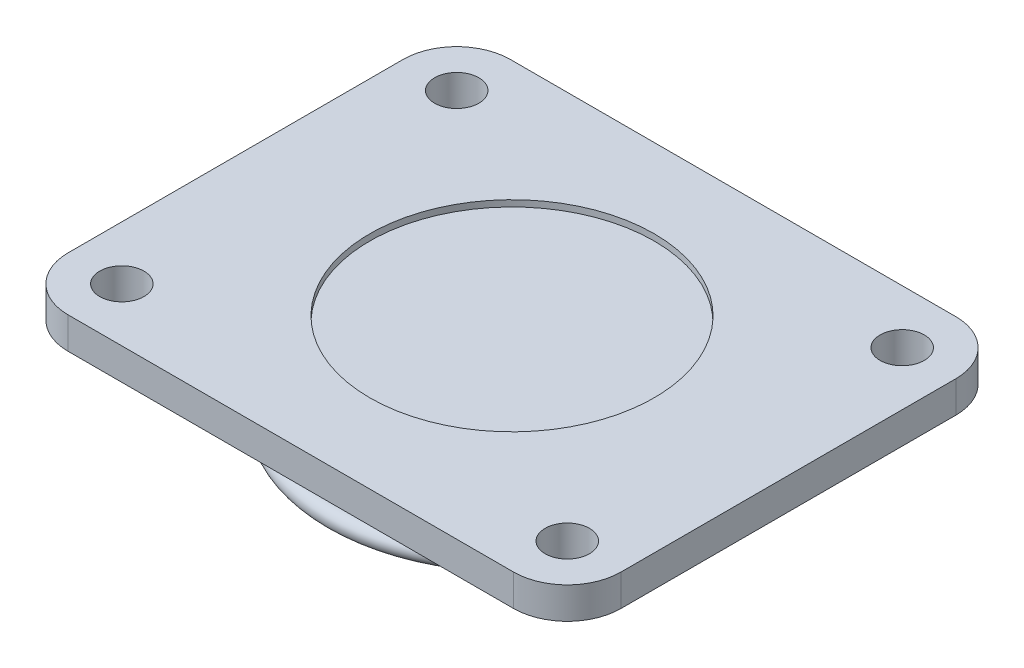
ISO-10303-21;
HEADER;
FILE_DESCRIPTION(('STEP AP214'),'2;1');
FILE_NAME('part.step','',(''),(''),'','','');
FILE_SCHEMA(('AUTOMOTIVE_DESIGN { 1 0 10303 214 1 1 1 1 }'));
ENDSEC;
DATA;
#1=APPLICATION_CONTEXT('core data for automotive mechanical design processes');
#2=APPLICATION_PROTOCOL_DEFINITION('international standard','automotive_design',2000,#1);
#3=PRODUCT_CONTEXT('',#1,'mechanical');
#4=PRODUCT('Part','Part','',(#3));
#5=PRODUCT_RELATED_PRODUCT_CATEGORY('part','',(#4));
#6=PRODUCT_DEFINITION_FORMATION('','',#4);
#7=PRODUCT_DEFINITION_CONTEXT('part definition',#1,'design');
#8=PRODUCT_DEFINITION('design','',#6,#7);
#9=PRODUCT_DEFINITION_SHAPE('','',#8);
#10=(LENGTH_UNIT() NAMED_UNIT(*) SI_UNIT(.MILLI.,.METRE.));
#11=(NAMED_UNIT(*) PLANE_ANGLE_UNIT() SI_UNIT($,.RADIAN.));
#12=(NAMED_UNIT(*) SI_UNIT($,.STERADIAN.) SOLID_ANGLE_UNIT());
#13=UNCERTAINTY_MEASURE_WITH_UNIT(LENGTH_MEASURE(1.E-05),#10,'distance_accuracy_value','');
#14=(GEOMETRIC_REPRESENTATION_CONTEXT(3) GLOBAL_UNCERTAINTY_ASSIGNED_CONTEXT((#13)) GLOBAL_UNIT_ASSIGNED_CONTEXT((#10,
#11,#12)) REPRESENTATION_CONTEXT('',''));
#15=CARTESIAN_POINT('',(0.,0.,0.));
#16=DIRECTION('',(0.,0.,1.));
#17=DIRECTION('',(1.,0.,0.));
#18=AXIS2_PLACEMENT_3D('',#15,#16,#17);
#19=CARTESIAN_POINT('',(70.5,10.,-53.));
#20=DIRECTION('',(0.,-1.,0.));
#21=DIRECTION('',(0.,0.,-1.));
#22=AXIS2_PLACEMENT_3D('',#19,#20,#21);
#23=PLANE('',#22);
#24=CARTESIAN_POINT('',(0.,10.,0.));
#25=DIRECTION('',(0.,1.,0.));
#26=DIRECTION('',(0.,0.,1.));
#27=AXIS2_PLACEMENT_3D('',#24,#25,#26);
#28=CIRCLE('',#27,45.);
#29=CARTESIAN_POINT('',(0.,10.,45.));
#30=VERTEX_POINT('',#29);
#31=EDGE_CURVE('E304',#30,#30,#28,.T.);
#32=ORIENTED_EDGE('',*,*,#31,.F.);
#33=EDGE_LOOP('',(#32));
#34=FACE_BOUND('',#33,.T.);
#35=CARTESIAN_POINT('',(70.5,10.,-53.));
#36=DIRECTION('',(0.,1.,0.));
#37=DIRECTION('',(0.,0.,-1.));
#38=AXIS2_PLACEMENT_3D('',#35,#36,#37);
#39=CIRCLE('',#38,17.);
#40=CARTESIAN_POINT('',(87.5,10.,-52.9999999999999));
#41=VERTEX_POINT('',#40);
#42=CARTESIAN_POINT('',(70.4999999999999,10.,-70.));
#43=VERTEX_POINT('',#42);
#44=EDGE_CURVE('E143',#41,#43,#39,.T.);
#45=ORIENTED_EDGE('',*,*,#44,.T.);
#46=DIRECTION('',(-1.,0.,0.));
#47=VECTOR('',#46,1.);
#48=CARTESIAN_POINT('',(-70.4999999999999,10.,-70.));
#49=LINE('',#48,#47);
#50=CARTESIAN_POINT('',(-70.4999999999999,10.,-70.));
#51=VERTEX_POINT('',#50);
#52=EDGE_CURVE('E77',#43,#51,#49,.T.);
#53=ORIENTED_EDGE('',*,*,#52,.T.);
#54=CARTESIAN_POINT('',(-70.5,10.,-53.));
#55=DIRECTION('',(0.,1.,0.));
#56=DIRECTION('',(0.,0.,-1.));
#57=AXIS2_PLACEMENT_3D('',#54,#55,#56);
#58=CIRCLE('',#57,17.);
#59=CARTESIAN_POINT('',(-87.5,10.,-52.9999999999999));
#60=VERTEX_POINT('',#59);
#61=EDGE_CURVE('E237',#51,#60,#58,.T.);
#62=ORIENTED_EDGE('',*,*,#61,.T.);
#63=DIRECTION('',(0.,0.,1.));
#64=VECTOR('',#63,1.);
#65=CARTESIAN_POINT('',(-87.5,10.,52.9999999999999));
#66=LINE('',#65,#64);
#67=CARTESIAN_POINT('',(-87.5,10.,52.9999999999999));
#68=VERTEX_POINT('',#67);
#69=EDGE_CURVE('E240',#60,#68,#66,.T.);
#70=ORIENTED_EDGE('',*,*,#69,.T.);
#71=CARTESIAN_POINT('',(-70.5,10.,53.));
#72=DIRECTION('',(0.,1.,0.));
#73=DIRECTION('',(0.,0.,-1.));
#74=AXIS2_PLACEMENT_3D('',#71,#72,#73);
#75=CIRCLE('',#74,17.);
#76=CARTESIAN_POINT('',(-70.4999999999999,10.,70.));
#77=VERTEX_POINT('',#76);
#78=EDGE_CURVE('E96',#68,#77,#75,.T.);
#79=ORIENTED_EDGE('',*,*,#78,.T.);
#80=DIRECTION('',(1.,0.,0.));
#81=VECTOR('',#80,1.);
#82=CARTESIAN_POINT('',(-70.4999999999999,10.,70.));
#83=LINE('',#82,#81);
#84=CARTESIAN_POINT('',(70.4999999999999,10.,70.));
#85=VERTEX_POINT('',#84);
#86=EDGE_CURVE('E90',#77,#85,#83,.T.);
#87=ORIENTED_EDGE('',*,*,#86,.T.);
#88=CARTESIAN_POINT('',(70.5,10.,53.));
#89=DIRECTION('',(0.,1.,0.));
#90=DIRECTION('',(0.,0.,1.));
#91=AXIS2_PLACEMENT_3D('',#88,#89,#90);
#92=CIRCLE('',#91,17.);
#93=CARTESIAN_POINT('',(87.5,10.,52.9999999999999));
#94=VERTEX_POINT('',#93);
#95=EDGE_CURVE('E94',#85,#94,#92,.T.);
#96=ORIENTED_EDGE('',*,*,#95,.T.);
#97=DIRECTION('',(0.,0.,-1.));
#98=VECTOR('',#97,1.);
#99=CARTESIAN_POINT('',(87.5,10.,52.9999999999999));
#100=LINE('',#99,#98);
#101=EDGE_CURVE('E33',#94,#41,#100,.T.);
#102=ORIENTED_EDGE('',*,*,#101,.T.);
#103=EDGE_LOOP('',(#45,#53,#62,#70,#79,#87,#96,#102));
#104=FACE_BOUND('',#103,.T.);
#105=CARTESIAN_POINT('',(-70.5,10.,-53.));
#106=DIRECTION('',(0.,1.,0.));
#107=DIRECTION('',(0.,0.,1.));
#108=AXIS2_PLACEMENT_3D('',#105,#106,#107);
#109=CIRCLE('',#108,7.);
#110=CARTESIAN_POINT('',(-70.5,10.,-46.));
#111=VERTEX_POINT('',#110);
#112=EDGE_CURVE('E125',#111,#111,#109,.T.);
#113=ORIENTED_EDGE('',*,*,#112,.F.);
#114=EDGE_LOOP('',(#113));
#115=FACE_BOUND('',#114,.T.);
#116=CARTESIAN_POINT('',(-70.5,10.,53.));
#117=DIRECTION('',(0.,1.,0.));
#118=DIRECTION('',(0.,0.,1.));
#119=AXIS2_PLACEMENT_3D('',#116,#117,#118);
#120=CIRCLE('',#119,7.);
#121=CARTESIAN_POINT('',(-70.5,10.,60.));
#122=VERTEX_POINT('',#121);
#123=EDGE_CURVE('E260',#122,#122,#120,.T.);
#124=ORIENTED_EDGE('',*,*,#123,.F.);
#125=EDGE_LOOP('',(#124));
#126=FACE_BOUND('',#125,.T.);
#127=CARTESIAN_POINT('',(70.5,10.,53.));
#128=DIRECTION('',(0.,1.,0.));
#129=DIRECTION('',(0.,0.,1.));
#130=AXIS2_PLACEMENT_3D('',#127,#128,#129);
#131=CIRCLE('',#130,7.);
#132=CARTESIAN_POINT('',(70.5,10.,60.));
#133=VERTEX_POINT('',#132);
#134=EDGE_CURVE('E268',#133,#133,#131,.T.);
#135=ORIENTED_EDGE('',*,*,#134,.F.);
#136=EDGE_LOOP('',(#135));
#137=FACE_BOUND('',#136,.T.);
#138=CARTESIAN_POINT('',(70.5,10.,-53.));
#139=DIRECTION('',(0.,1.,0.));
#140=DIRECTION('',(0.,0.,1.));
#141=AXIS2_PLACEMENT_3D('',#138,#139,#140);
#142=CIRCLE('',#141,7.);
#143=CARTESIAN_POINT('',(70.5,10.,-46.));
#144=VERTEX_POINT('',#143);
#145=EDGE_CURVE('E276',#144,#144,#142,.T.);
#146=ORIENTED_EDGE('',*,*,#145,.F.);
#147=EDGE_LOOP('',(#146));
#148=FACE_BOUND('',#147,.T.);
#149=ADVANCED_FACE('F15',(#34,#104,#115,#126,#137,#148),#23,.F.);
#150=CARTESIAN_POINT('',(70.5,0.,-53.));
#151=DIRECTION('',(0.,-1.,0.));
#152=DIRECTION('',(0.,0.,-1.));
#153=AXIS2_PLACEMENT_3D('',#150,#151,#152);
#154=PLANE('',#153);
#155=CARTESIAN_POINT('',(0.,0.,0.));
#156=DIRECTION('',(0.,-1.,0.));
#157=DIRECTION('',(0.,0.,-1.));
#158=AXIS2_PLACEMENT_3D('',#155,#156,#157);
#159=CIRCLE('',#158,56.);
#160=CARTESIAN_POINT('',(0.,0.,-56.));
#161=VERTEX_POINT('',#160);
#162=EDGE_CURVE('E284',#161,#161,#159,.T.);
#163=ORIENTED_EDGE('',*,*,#162,.F.);
#164=EDGE_LOOP('',(#163));
#165=FACE_BOUND('',#164,.T.);
#166=CARTESIAN_POINT('',(70.5,0.,53.));
#167=DIRECTION('',(0.,1.,0.));
#168=DIRECTION('',(0.,0.,1.));
#169=AXIS2_PLACEMENT_3D('',#166,#167,#168);
#170=CIRCLE('',#169,7.);
#171=CARTESIAN_POINT('',(70.5,0.,60.));
#172=VERTEX_POINT('',#171);
#173=EDGE_CURVE('E272',#172,#172,#170,.T.);
#174=ORIENTED_EDGE('',*,*,#173,.T.);
#175=EDGE_LOOP('',(#174));
#176=FACE_BOUND('',#175,.T.);
#177=CARTESIAN_POINT('',(-70.5,0.,-53.));
#178=DIRECTION('',(0.,1.,0.));
#179=DIRECTION('',(0.,0.,1.));
#180=AXIS2_PLACEMENT_3D('',#177,#178,#179);
#181=CIRCLE('',#180,7.);
#182=CARTESIAN_POINT('',(-70.5,0.,-46.));
#183=VERTEX_POINT('',#182);
#184=EDGE_CURVE('E256',#183,#183,#181,.T.);
#185=ORIENTED_EDGE('',*,*,#184,.T.);
#186=EDGE_LOOP('',(#185));
#187=FACE_BOUND('',#186,.T.);
#188=CARTESIAN_POINT('',(70.5,0.,-53.));
#189=DIRECTION('',(0.,1.,0.));
#190=DIRECTION('',(0.,0.,-1.));
#191=AXIS2_PLACEMENT_3D('',#188,#189,#190);
#192=CIRCLE('',#191,17.);
#193=CARTESIAN_POINT('',(87.5,0.,-52.9999999999999));
#194=VERTEX_POINT('',#193);
#195=CARTESIAN_POINT('',(70.4999999999999,0.,-70.));
#196=VERTEX_POINT('',#195);
#197=EDGE_CURVE('E120',#194,#196,#192,.T.);
#198=ORIENTED_EDGE('',*,*,#197,.F.);
#199=DIRECTION('',(0.,0.,-1.));
#200=VECTOR('',#199,1.);
#201=CARTESIAN_POINT('',(87.5,0.,52.9999999999999));
#202=LINE('',#201,#200);
#203=CARTESIAN_POINT('',(87.5,0.,52.9999999999999));
#204=VERTEX_POINT('',#203);
#205=EDGE_CURVE('E68',#204,#194,#202,.T.);
#206=ORIENTED_EDGE('',*,*,#205,.F.);
#207=CARTESIAN_POINT('',(70.5,0.,53.));
#208=DIRECTION('',(0.,1.,0.));
#209=DIRECTION('',(0.,0.,1.));
#210=AXIS2_PLACEMENT_3D('',#207,#208,#209);
#211=CIRCLE('',#210,17.);
#212=CARTESIAN_POINT('',(70.4999999999999,0.,70.));
#213=VERTEX_POINT('',#212);
#214=EDGE_CURVE('E62',#213,#204,#211,.T.);
#215=ORIENTED_EDGE('',*,*,#214,.F.);
#216=DIRECTION('',(1.,0.,0.));
#217=VECTOR('',#216,1.);
#218=CARTESIAN_POINT('',(-70.4999999999999,0.,70.));
#219=LINE('',#218,#217);
#220=CARTESIAN_POINT('',(-70.4999999999999,0.,70.));
#221=VERTEX_POINT('',#220);
#222=EDGE_CURVE('E105',#221,#213,#219,.T.);
#223=ORIENTED_EDGE('',*,*,#222,.F.);
#224=CARTESIAN_POINT('',(-70.5,0.,53.));
#225=DIRECTION('',(0.,1.,0.));
#226=DIRECTION('',(0.,0.,-1.));
#227=AXIS2_PLACEMENT_3D('',#224,#225,#226);
#228=CIRCLE('',#227,17.);
#229=CARTESIAN_POINT('',(-87.5,0.,52.9999999999999));
#230=VERTEX_POINT('',#229);
#231=EDGE_CURVE('E134',#230,#221,#228,.T.);
#232=ORIENTED_EDGE('',*,*,#231,.F.);
#233=DIRECTION('',(0.,0.,1.));
#234=VECTOR('',#233,1.);
#235=CARTESIAN_POINT('',(-87.5,0.,52.9999999999999));
#236=LINE('',#235,#234);
#237=CARTESIAN_POINT('',(-87.5,0.,-52.9999999999999));
#238=VERTEX_POINT('',#237);
#239=EDGE_CURVE('E131',#238,#230,#236,.T.);
#240=ORIENTED_EDGE('',*,*,#239,.F.);
#241=CARTESIAN_POINT('',(-70.5,0.,-53.));
#242=DIRECTION('',(0.,1.,0.));
#243=DIRECTION('',(0.,0.,-1.));
#244=AXIS2_PLACEMENT_3D('',#241,#242,#243);
#245=CIRCLE('',#244,17.);
#246=CARTESIAN_POINT('',(-70.4999999999999,0.,-70.));
#247=VERTEX_POINT('',#246);
#248=EDGE_CURVE('E128',#247,#238,#245,.T.);
#249=ORIENTED_EDGE('',*,*,#248,.F.);
#250=DIRECTION('',(-1.,0.,0.));
#251=VECTOR('',#250,1.);
#252=CARTESIAN_POINT('',(-70.4999999999999,0.,-70.));
#253=LINE('',#252,#251);
#254=EDGE_CURVE('E124',#196,#247,#253,.T.);
#255=ORIENTED_EDGE('',*,*,#254,.F.);
#256=EDGE_LOOP('',(#198,#206,#215,#223,#232,#240,#249,#255));
#257=FACE_BOUND('',#256,.T.);
#258=CARTESIAN_POINT('',(-70.5,0.,53.));
#259=DIRECTION('',(0.,1.,0.));
#260=DIRECTION('',(0.,0.,1.));
#261=AXIS2_PLACEMENT_3D('',#258,#259,#260);
#262=CIRCLE('',#261,7.);
#263=CARTESIAN_POINT('',(-70.5,0.,60.));
#264=VERTEX_POINT('',#263);
#265=EDGE_CURVE('E264',#264,#264,#262,.T.);
#266=ORIENTED_EDGE('',*,*,#265,.T.);
#267=EDGE_LOOP('',(#266));
#268=FACE_BOUND('',#267,.T.);
#269=CARTESIAN_POINT('',(70.5,0.,-53.));
#270=DIRECTION('',(0.,1.,0.));
#271=DIRECTION('',(0.,0.,1.));
#272=AXIS2_PLACEMENT_3D('',#269,#270,#271);
#273=CIRCLE('',#272,7.);
#274=CARTESIAN_POINT('',(70.5,0.,-46.));
#275=VERTEX_POINT('',#274);
#276=EDGE_CURVE('E280',#275,#275,#273,.T.);
#277=ORIENTED_EDGE('',*,*,#276,.T.);
#278=EDGE_LOOP('',(#277));
#279=FACE_BOUND('',#278,.T.);
#280=ADVANCED_FACE('F187',(#165,#176,#187,#257,#268,#279),#154,.T.);
#281=CARTESIAN_POINT('',(70.5,10.,-53.));
#282=DIRECTION('',(0.,-1.,0.));
#283=DIRECTION('',(0.,0.,-1.));
#284=AXIS2_PLACEMENT_3D('',#281,#282,#283);
#285=CYLINDRICAL_SURFACE('',#284,17.);
#286=ORIENTED_EDGE('',*,*,#197,.T.);
#287=DIRECTION('',(0.,-1.,0.));
#288=VECTOR('',#287,1.);
#289=CARTESIAN_POINT('',(70.4999999999999,10.,-70.));
#290=LINE('',#289,#288);
#291=EDGE_CURVE('E162',#43,#196,#290,.T.);
#292=ORIENTED_EDGE('',*,*,#291,.F.);
#293=ORIENTED_EDGE('',*,*,#44,.F.);
#294=DIRECTION('',(0.,-1.,0.));
#295=VECTOR('',#294,1.);
#296=CARTESIAN_POINT('',(87.5,10.,-52.9999999999999));
#297=LINE('',#296,#295);
#298=EDGE_CURVE('E116',#41,#194,#297,.T.);
#299=ORIENTED_EDGE('',*,*,#298,.T.);
#300=EDGE_LOOP('',(#286,#292,#293,#299));
#301=FACE_BOUND('',#300,.T.);
#302=ADVANCED_FACE('F194',(#301),#285,.T.);
#303=CARTESIAN_POINT('',(-70.4999999999999,10.,-70.));
#304=DIRECTION('',(0.,0.,1.));
#305=DIRECTION('',(1.,0.,0.));
#306=AXIS2_PLACEMENT_3D('',#303,#304,#305);
#307=PLANE('',#306);
#308=ORIENTED_EDGE('',*,*,#254,.T.);
#309=DIRECTION('',(0.,-1.,0.));
#310=VECTOR('',#309,1.);
#311=CARTESIAN_POINT('',(-70.4999999999999,10.,-70.));
#312=LINE('',#311,#310);
#313=EDGE_CURVE('E158',#51,#247,#312,.T.);
#314=ORIENTED_EDGE('',*,*,#313,.F.);
#315=ORIENTED_EDGE('',*,*,#52,.F.);
#316=ORIENTED_EDGE('',*,*,#291,.T.);
#317=EDGE_LOOP('',(#308,#314,#315,#316));
#318=FACE_BOUND('',#317,.T.);
#319=ADVANCED_FACE('F220',(#318),#307,.F.);
#320=CARTESIAN_POINT('',(-70.5,10.,-53.));
#321=DIRECTION('',(0.,-1.,0.));
#322=DIRECTION('',(0.,0.,-1.));
#323=AXIS2_PLACEMENT_3D('',#320,#321,#322);
#324=CYLINDRICAL_SURFACE('',#323,17.);
#325=ORIENTED_EDGE('',*,*,#248,.T.);
#326=DIRECTION('',(0.,-1.,0.));
#327=VECTOR('',#326,1.);
#328=CARTESIAN_POINT('',(-87.5,10.,-52.9999999999999));
#329=LINE('',#328,#327);
#330=EDGE_CURVE('E154',#60,#238,#329,.T.);
#331=ORIENTED_EDGE('',*,*,#330,.F.);
#332=ORIENTED_EDGE('',*,*,#61,.F.);
#333=ORIENTED_EDGE('',*,*,#313,.T.);
#334=EDGE_LOOP('',(#325,#331,#332,#333));
#335=FACE_BOUND('',#334,.T.);
#336=ADVANCED_FACE('F216',(#335),#324,.T.);
#337=CARTESIAN_POINT('',(-87.5,10.,52.9999999999999));
#338=DIRECTION('',(1.,0.,0.));
#339=DIRECTION('',(0.,0.,-1.));
#340=AXIS2_PLACEMENT_3D('',#337,#338,#339);
#341=PLANE('',#340);
#342=ORIENTED_EDGE('',*,*,#239,.T.);
#343=DIRECTION('',(0.,-1.,0.));
#344=VECTOR('',#343,1.);
#345=CARTESIAN_POINT('',(-87.5,10.,52.9999999999999));
#346=LINE('',#345,#344);
#347=EDGE_CURVE('E150',#68,#230,#346,.T.);
#348=ORIENTED_EDGE('',*,*,#347,.F.);
#349=ORIENTED_EDGE('',*,*,#69,.F.);
#350=ORIENTED_EDGE('',*,*,#330,.T.);
#351=EDGE_LOOP('',(#342,#348,#349,#350));
#352=FACE_BOUND('',#351,.T.);
#353=ADVANCED_FACE('F212',(#352),#341,.F.);
#354=CARTESIAN_POINT('',(-70.5,10.,53.));
#355=DIRECTION('',(0.,-1.,0.));
#356=DIRECTION('',(0.,0.,-1.));
#357=AXIS2_PLACEMENT_3D('',#354,#355,#356);
#358=CYLINDRICAL_SURFACE('',#357,17.);
#359=ORIENTED_EDGE('',*,*,#231,.T.);
#360=DIRECTION('',(0.,-1.,0.));
#361=VECTOR('',#360,1.);
#362=CARTESIAN_POINT('',(-70.4999999999999,10.,70.));
#363=LINE('',#362,#361);
#364=EDGE_CURVE('E107',#77,#221,#363,.T.);
#365=ORIENTED_EDGE('',*,*,#364,.F.);
#366=ORIENTED_EDGE('',*,*,#78,.F.);
#367=ORIENTED_EDGE('',*,*,#347,.T.);
#368=EDGE_LOOP('',(#359,#365,#366,#367));
#369=FACE_BOUND('',#368,.T.);
#370=ADVANCED_FACE('F209',(#369),#358,.T.);
#371=CARTESIAN_POINT('',(-70.4999999999999,10.,70.));
#372=DIRECTION('',(0.,0.,-1.));
#373=DIRECTION('',(-1.,0.,0.));
#374=AXIS2_PLACEMENT_3D('',#371,#372,#373);
#375=PLANE('',#374);
#376=ORIENTED_EDGE('',*,*,#222,.T.);
#377=DIRECTION('',(0.,-1.,0.));
#378=VECTOR('',#377,1.);
#379=CARTESIAN_POINT('',(70.4999999999999,10.,70.));
#380=LINE('',#379,#378);
#381=EDGE_CURVE('E102',#85,#213,#380,.T.);
#382=ORIENTED_EDGE('',*,*,#381,.F.);
#383=ORIENTED_EDGE('',*,*,#86,.F.);
#384=ORIENTED_EDGE('',*,*,#364,.T.);
#385=EDGE_LOOP('',(#376,#382,#383,#384));
#386=FACE_BOUND('',#385,.T.);
#387=ADVANCED_FACE('F103',(#386),#375,.F.);
#388=CARTESIAN_POINT('',(70.5,10.,53.));
#389=DIRECTION('',(0.,-1.,0.));
#390=DIRECTION('',(0.,0.,-1.));
#391=AXIS2_PLACEMENT_3D('',#388,#389,#390);
#392=CYLINDRICAL_SURFACE('',#391,17.);
#393=ORIENTED_EDGE('',*,*,#214,.T.);
#394=DIRECTION('',(0.,-1.,0.));
#395=VECTOR('',#394,1.);
#396=CARTESIAN_POINT('',(87.5,10.,52.9999999999999));
#397=LINE('',#396,#395);
#398=EDGE_CURVE('E108',#94,#204,#397,.T.);
#399=ORIENTED_EDGE('',*,*,#398,.F.);
#400=ORIENTED_EDGE('',*,*,#95,.F.);
#401=ORIENTED_EDGE('',*,*,#381,.T.);
#402=EDGE_LOOP('',(#393,#399,#400,#401));
#403=FACE_BOUND('',#402,.T.);
#404=ADVANCED_FACE('F110',(#403),#392,.T.);
#405=CARTESIAN_POINT('',(87.5,10.,52.9999999999999));
#406=DIRECTION('',(-1.,0.,0.));
#407=DIRECTION('',(0.,0.,1.));
#408=AXIS2_PLACEMENT_3D('',#405,#406,#407);
#409=PLANE('',#408);
#410=ORIENTED_EDGE('',*,*,#205,.T.);
#411=ORIENTED_EDGE('',*,*,#298,.F.);
#412=ORIENTED_EDGE('',*,*,#101,.F.);
#413=ORIENTED_EDGE('',*,*,#398,.T.);
#414=EDGE_LOOP('',(#410,#411,#412,#413));
#415=FACE_BOUND('',#414,.T.);
#416=ADVANCED_FACE('F202',(#415),#409,.F.);
#417=CARTESIAN_POINT('',(-70.5,10.,-53.));
#418=DIRECTION('',(0.,-1.,0.));
#419=DIRECTION('',(0.,0.,-1.));
#420=AXIS2_PLACEMENT_3D('',#417,#418,#419);
#421=CYLINDRICAL_SURFACE('',#420,7.);
#422=ORIENTED_EDGE('',*,*,#112,.T.);
#423=EDGE_LOOP('',(#422));
#424=FACE_BOUND('',#423,.T.);
#425=ORIENTED_EDGE('',*,*,#184,.F.);
#426=EDGE_LOOP('',(#425));
#427=FACE_BOUND('',#426,.T.);
#428=ADVANCED_FACE('F199',(#424,#427),#421,.F.);
#429=CARTESIAN_POINT('',(-70.5,10.,53.));
#430=DIRECTION('',(0.,-1.,0.));
#431=DIRECTION('',(0.,0.,-1.));
#432=AXIS2_PLACEMENT_3D('',#429,#430,#431);
#433=CYLINDRICAL_SURFACE('',#432,7.);
#434=ORIENTED_EDGE('',*,*,#123,.T.);
#435=EDGE_LOOP('',(#434));
#436=FACE_BOUND('',#435,.T.);
#437=ORIENTED_EDGE('',*,*,#265,.F.);
#438=EDGE_LOOP('',(#437));
#439=FACE_BOUND('',#438,.T.);
#440=ADVANCED_FACE('F341',(#436,#439),#433,.F.);
#441=CARTESIAN_POINT('',(70.5,10.,53.));
#442=DIRECTION('',(0.,-1.,0.));
#443=DIRECTION('',(0.,0.,-1.));
#444=AXIS2_PLACEMENT_3D('',#441,#442,#443);
#445=CYLINDRICAL_SURFACE('',#444,7.);
#446=ORIENTED_EDGE('',*,*,#134,.T.);
#447=EDGE_LOOP('',(#446));
#448=FACE_BOUND('',#447,.T.);
#449=ORIENTED_EDGE('',*,*,#173,.F.);
#450=EDGE_LOOP('',(#449));
#451=FACE_BOUND('',#450,.T.);
#452=ADVANCED_FACE('F338',(#448,#451),#445,.F.);
#453=CARTESIAN_POINT('',(70.5,10.,-53.));
#454=DIRECTION('',(0.,-1.,0.));
#455=DIRECTION('',(0.,0.,-1.));
#456=AXIS2_PLACEMENT_3D('',#453,#454,#455);
#457=CYLINDRICAL_SURFACE('',#456,7.);
#458=ORIENTED_EDGE('',*,*,#145,.T.);
#459=EDGE_LOOP('',(#458));
#460=FACE_BOUND('',#459,.T.);
#461=ORIENTED_EDGE('',*,*,#276,.F.);
#462=EDGE_LOOP('',(#461));
#463=FACE_BOUND('',#462,.T.);
#464=ADVANCED_FACE('F334',(#460,#463),#457,.F.);
#465=CARTESIAN_POINT('',(0.,-20.,0.));
#466=DIRECTION('',(0.,1.,0.));
#467=DIRECTION('',(0.,0.,1.));
#468=AXIS2_PLACEMENT_3D('',#465,#466,#467);
#469=CYLINDRICAL_SURFACE('',#468,56.);
#470=CARTESIAN_POINT('',(0.,-14.,0.));
#471=DIRECTION('',(0.,-1.,0.));
#472=DIRECTION('',(0.,0.,-1.));
#473=AXIS2_PLACEMENT_3D('',#470,#471,#472);
#474=CIRCLE('',#473,56.);
#475=CARTESIAN_POINT('',(0.,-14.,-56.));
#476=VERTEX_POINT('',#475);
#477=EDGE_CURVE('E291',#476,#476,#474,.F.);
#478=ORIENTED_EDGE('',*,*,#477,.T.);
#479=EDGE_LOOP('',(#478));
#480=FACE_BOUND('',#479,.T.);
#481=ORIENTED_EDGE('',*,*,#162,.T.);
#482=EDGE_LOOP('',(#481));
#483=FACE_BOUND('',#482,.T.);
#484=ADVANCED_FACE('F327',(#480,#483),#469,.T.);
#485=CARTESIAN_POINT('',(0.,-17.,0.));
#486=DIRECTION('',(0.,1.,0.));
#487=DIRECTION('',(0.,0.,1.));
#488=AXIS2_PLACEMENT_3D('',#485,#486,#487);
#489=TOROIDAL_SURFACE('',#488,56.,3.);
#490=CARTESIAN_POINT('',(0.,-20.,0.));
#491=DIRECTION('',(0.,1.,0.));
#492=DIRECTION('',(0.,0.,1.));
#493=AXIS2_PLACEMENT_3D('',#490,#491,#492);
#494=CIRCLE('',#493,56.);
#495=CARTESIAN_POINT('',(0.,-20.,56.));
#496=VERTEX_POINT('',#495);
#497=EDGE_CURVE('E295',#496,#496,#494,.T.);
#498=ORIENTED_EDGE('',*,*,#497,.T.);
#499=EDGE_LOOP('',(#498));
#500=FACE_BOUND('',#499,.T.);
#501=ORIENTED_EDGE('',*,*,#477,.F.);
#502=EDGE_LOOP('',(#501));
#503=FACE_BOUND('',#502,.T.);
#504=ADVANCED_FACE('F324',(#500,#503),#489,.T.);
#505=CARTESIAN_POINT('',(0.,-20.,0.));
#506=DIRECTION('',(0.,-1.,0.));
#507=DIRECTION('',(0.,0.,-1.));
#508=AXIS2_PLACEMENT_3D('',#505,#506,#507);
#509=PLANE('',#508);
#510=CARTESIAN_POINT('',(0.,-20.,0.));
#511=DIRECTION('',(0.,-1.,0.));
#512=DIRECTION('',(0.,0.,-1.));
#513=AXIS2_PLACEMENT_3D('',#510,#511,#512);
#514=CIRCLE('',#513,7.5);
#515=CARTESIAN_POINT('',(0.,-20.,-7.5));
#516=VERTEX_POINT('',#515);
#517=EDGE_CURVE('E299',#516,#516,#514,.T.);
#518=ORIENTED_EDGE('',*,*,#517,.F.);
#519=EDGE_LOOP('',(#518));
#520=FACE_BOUND('',#519,.T.);
#521=ORIENTED_EDGE('',*,*,#497,.F.);
#522=EDGE_LOOP('',(#521));
#523=FACE_BOUND('',#522,.T.);
#524=ADVANCED_FACE('F322',(#520,#523),#509,.T.);
#525=CARTESIAN_POINT('',(0.,-45.,0.));
#526=DIRECTION('',(0.,1.,0.));
#527=DIRECTION('',(0.,0.,1.));
#528=AXIS2_PLACEMENT_3D('',#525,#526,#527);
#529=CYLINDRICAL_SURFACE('',#528,7.5);
#530=CARTESIAN_POINT('',(0.,-44.,0.));
#531=DIRECTION('',(0.,-1.,0.));
#532=DIRECTION('',(0.,0.,-1.));
#533=AXIS2_PLACEMENT_3D('',#530,#531,#532);
#534=CIRCLE('',#533,7.5);
#535=CARTESIAN_POINT('',(0.,-44.,-7.5));
#536=VERTEX_POINT('',#535);
#537=EDGE_CURVE('E10',#536,#536,#534,.F.);
#538=ORIENTED_EDGE('',*,*,#537,.T.);
#539=EDGE_LOOP('',(#538));
#540=FACE_BOUND('',#539,.T.);
#541=ORIENTED_EDGE('',*,*,#517,.T.);
#542=EDGE_LOOP('',(#541));
#543=FACE_BOUND('',#542,.T.);
#544=ADVANCED_FACE('F183',(#540,#543),#529,.T.);
#545=CARTESIAN_POINT('',(0.,-45.,0.));
#546=DIRECTION('',(0.,-1.,0.));
#547=DIRECTION('',(0.,0.,-1.));
#548=AXIS2_PLACEMENT_3D('',#545,#546,#547);
#549=PLANE('',#548);
#550=CARTESIAN_POINT('',(0.,-45.,0.));
#551=DIRECTION('',(0.,-1.,0.));
#552=DIRECTION('',(0.,0.,-1.));
#553=AXIS2_PLACEMENT_3D('',#550,#551,#552);
#554=CIRCLE('',#553,6.50000000000001);
#555=CARTESIAN_POINT('',(0.,-45.,-6.50000000000001));
#556=VERTEX_POINT('',#555);
#557=EDGE_CURVE('E25',#556,#556,#554,.T.);
#558=ORIENTED_EDGE('',*,*,#557,.T.);
#559=EDGE_LOOP('',(#558));
#560=FACE_BOUND('',#559,.T.);
#561=ADVANCED_FACE('F169',(#560),#549,.T.);
#562=CARTESIAN_POINT('',(0.,-45.,0.));
#563=DIRECTION('',(0.,1.,0.));
#564=DIRECTION('',(0.,0.,1.));
#565=AXIS2_PLACEMENT_3D('',#562,#563,#564);
#566=CONICAL_SURFACE('',#565,6.50000000000001,0.785398163397435);
#567=ORIENTED_EDGE('',*,*,#537,.F.);
#568=EDGE_LOOP('',(#567));
#569=FACE_BOUND('',#568,.T.);
#570=ORIENTED_EDGE('',*,*,#557,.F.);
#571=EDGE_LOOP('',(#570));
#572=FACE_BOUND('',#571,.T.);
#573=ADVANCED_FACE('F17',(#569,#572),#566,.T.);
#574=CARTESIAN_POINT('',(0.,8.,0.));
#575=DIRECTION('',(0.,1.,0.));
#576=DIRECTION('',(0.,0.,1.));
#577=AXIS2_PLACEMENT_3D('',#574,#575,#576);
#578=CYLINDRICAL_SURFACE('',#577,45.);
#579=CARTESIAN_POINT('',(0.,8.,0.));
#580=DIRECTION('',(0.,1.,0.));
#581=DIRECTION('',(0.,0.,1.));
#582=AXIS2_PLACEMENT_3D('',#579,#580,#581);
#583=CIRCLE('',#582,45.);
#584=CARTESIAN_POINT('',(0.,8.,45.));
#585=VERTEX_POINT('',#584);
#586=EDGE_CURVE('E303',#585,#585,#583,.T.);
#587=ORIENTED_EDGE('',*,*,#586,.F.);
#588=EDGE_LOOP('',(#587));
#589=FACE_BOUND('',#588,.T.);
#590=ORIENTED_EDGE('',*,*,#31,.T.);
#591=EDGE_LOOP('',(#590));
#592=FACE_BOUND('',#591,.T.);
#593=ADVANCED_FACE('F172',(#589,#592),#578,.F.);
#594=CARTESIAN_POINT('',(0.,8.,0.));
#595=DIRECTION('',(0.,1.,0.));
#596=DIRECTION('',(0.,0.,1.));
#597=AXIS2_PLACEMENT_3D('',#594,#595,#596);
#598=PLANE('',#597);
#599=ORIENTED_EDGE('',*,*,#586,.T.);
#600=EDGE_LOOP('',(#599));
#601=FACE_BOUND('',#600,.T.);
#602=ADVANCED_FACE('F180',(#601),#598,.T.);
#603=CLOSED_SHELL('',(#149,#280,#302,#319,#336,#353,#370,#387,#404,#416,#428,#440,#452,#464,
#484,#504,#524,#544,#561,#573,#593,#602));
#604=MANIFOLD_SOLID_BREP('B1',#603);
#605=ADVANCED_BREP_SHAPE_REPRESENTATION('',(#18,#604),#14);
#606=SHAPE_DEFINITION_REPRESENTATION(#9,#605);
ENDSEC;
END-ISO-10303-21;
